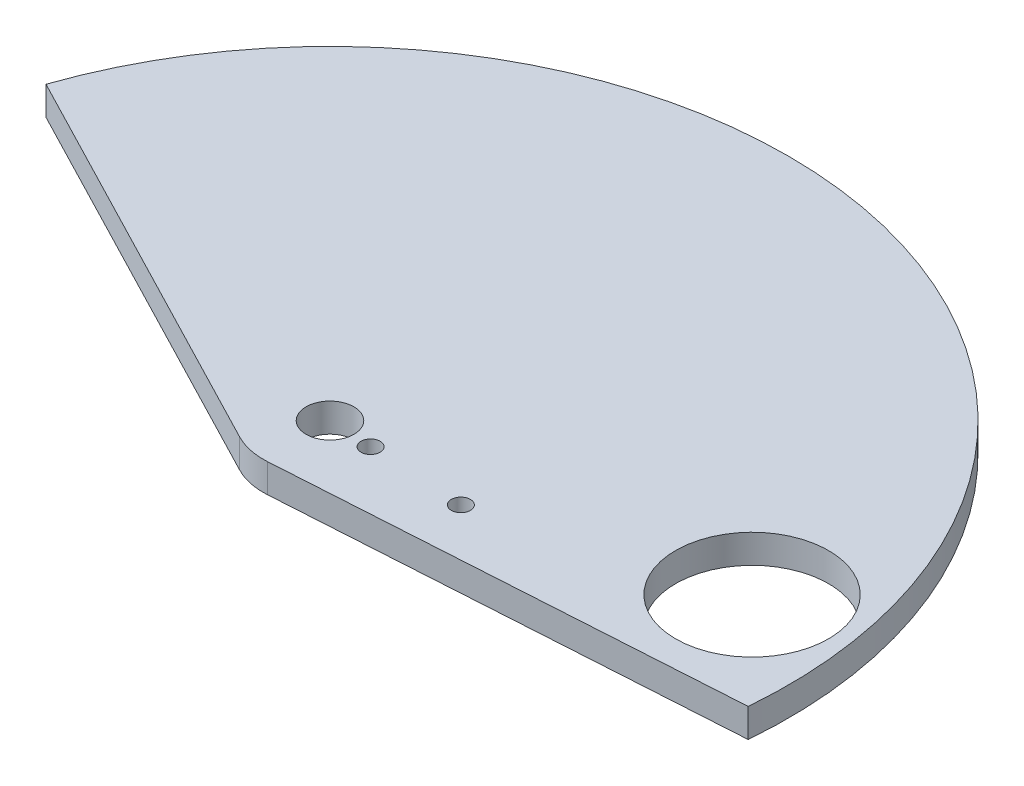
ISO-10303-21;
HEADER;
FILE_DESCRIPTION(('STEP AP214'),'2;1');
FILE_NAME('part.step','',(''),(''),'','','');
FILE_SCHEMA(('AUTOMOTIVE_DESIGN { 1 0 10303 214 1 1 1 1 }'));
ENDSEC;
DATA;
#1=APPLICATION_CONTEXT('core data for automotive mechanical design processes');
#2=APPLICATION_PROTOCOL_DEFINITION('international standard','automotive_design',2000,#1);
#3=PRODUCT_CONTEXT('',#1,'mechanical');
#4=PRODUCT('Part','Part','',(#3));
#5=PRODUCT_RELATED_PRODUCT_CATEGORY('part','',(#4));
#6=PRODUCT_DEFINITION_FORMATION('','',#4);
#7=PRODUCT_DEFINITION_CONTEXT('part definition',#1,'design');
#8=PRODUCT_DEFINITION('design','',#6,#7);
#9=PRODUCT_DEFINITION_SHAPE('','',#8);
#10=(LENGTH_UNIT() NAMED_UNIT(*) SI_UNIT(.MILLI.,.METRE.));
#11=(NAMED_UNIT(*) PLANE_ANGLE_UNIT() SI_UNIT($,.RADIAN.));
#12=(NAMED_UNIT(*) SI_UNIT($,.STERADIAN.) SOLID_ANGLE_UNIT());
#13=UNCERTAINTY_MEASURE_WITH_UNIT(LENGTH_MEASURE(1.E-05),#10,'distance_accuracy_value','');
#14=(GEOMETRIC_REPRESENTATION_CONTEXT(3) GLOBAL_UNCERTAINTY_ASSIGNED_CONTEXT((#13)) GLOBAL_UNIT_ASSIGNED_CONTEXT((#10,
#11,#12)) REPRESENTATION_CONTEXT('',''));
#15=CARTESIAN_POINT('',(0.,0.,0.));
#16=DIRECTION('',(0.,0.,1.));
#17=DIRECTION('',(1.,0.,0.));
#18=AXIS2_PLACEMENT_3D('',#15,#16,#17);
#19=CARTESIAN_POINT('',(0.713081425590482,3.,-1.37503951607775));
#20=DIRECTION('',(0.460367012726996,0.,-0.887728682420942));
#21=DIRECTION('',(-0.887728682420942,0.,-0.460367012726996));
#22=AXIS2_PLACEMENT_3D('',#19,#20,#21);
#23=PLANE('',#22);
#24=DIRECTION('',(0.887728682420942,0.,0.460367012726996));
#25=VECTOR('',#24,1.);
#26=CARTESIAN_POINT('',(0.713081425590482,0.,-1.37503951607775));
#27=LINE('',#26,#25);
#28=CARTESIAN_POINT('',(-38.306620426408,0.,-21.6102577024658));
#29=VERTEX_POINT('',#28);
#30=CARTESIAN_POINT('',(3.77743091091103,0.,0.214100776946594));
#31=VERTEX_POINT('',#30);
#32=EDGE_CURVE('E115',#29,#31,#27,.T.);
#33=ORIENTED_EDGE('',*,*,#32,.T.);
#34=DIRECTION('',(0.,-1.,0.));
#35=VECTOR('',#34,1.);
#36=CARTESIAN_POINT('',(3.77743091091103,3.,0.214100776946594));
#37=LINE('',#36,#35);
#38=CARTESIAN_POINT('',(3.77743091091103,3.,0.214100776946594));
#39=VERTEX_POINT('',#38);
#40=EDGE_CURVE('E11',#39,#31,#37,.T.);
#41=ORIENTED_EDGE('',*,*,#40,.F.);
#42=DIRECTION('',(0.887728682420942,0.,0.460367012726996));
#43=VECTOR('',#42,1.);
#44=CARTESIAN_POINT('',(0.713081425590482,3.,-1.37503951607775));
#45=LINE('',#44,#43);
#46=CARTESIAN_POINT('',(-38.306620426408,3.,-21.6102577024658));
#47=VERTEX_POINT('',#46);
#48=EDGE_CURVE('E91',#47,#39,#45,.T.);
#49=ORIENTED_EDGE('',*,*,#48,.F.);
#50=DIRECTION('',(0.,-1.,0.));
#51=VECTOR('',#50,1.);
#52=CARTESIAN_POINT('',(-38.306620426408,3.,-21.6102577024658));
#53=LINE('',#52,#51);
#54=EDGE_CURVE('E99',#47,#29,#53,.T.);
#55=ORIENTED_EDGE('',*,*,#54,.T.);
#56=EDGE_LOOP('',(#33,#41,#49,#55));
#57=FACE_BOUND('',#56,.T.);
#58=ADVANCED_FACE('F39',(#57),#23,.F.);
#59=CARTESIAN_POINT('',(7.,3.,-6.00000000000001));
#60=DIRECTION('',(0.,-1.,0.));
#61=DIRECTION('',(0.,0.,-1.));
#62=AXIS2_PLACEMENT_3D('',#59,#60,#61);
#63=CYLINDRICAL_SURFACE('',#62,7.);
#64=CARTESIAN_POINT('',(7.,0.,-6.00000000000001));
#65=DIRECTION('',(0.,1.,0.));
#66=DIRECTION('',(0.,0.,1.));
#67=AXIS2_PLACEMENT_3D('',#64,#65,#66);
#68=CIRCLE('',#67,7.);
#69=CARTESIAN_POINT('',(7.43802830898424,0.,0.986281643372844));
#70=VERTEX_POINT('',#69);
#71=EDGE_CURVE('E95',#31,#70,#68,.T.);
#72=ORIENTED_EDGE('',*,*,#71,.T.);
#73=DIRECTION('',(0.,-1.,0.));
#74=VECTOR('',#73,1.);
#75=CARTESIAN_POINT('',(7.43802830898424,3.,0.986281643372844));
#76=LINE('',#75,#74);
#77=CARTESIAN_POINT('',(7.43802830898424,3.,0.986281643372844));
#78=VERTEX_POINT('',#77);
#79=EDGE_CURVE('E48',#78,#70,#76,.T.);
#80=ORIENTED_EDGE('',*,*,#79,.F.);
#81=CARTESIAN_POINT('',(7.,3.,-6.00000000000001));
#82=DIRECTION('',(0.,1.,0.));
#83=DIRECTION('',(0.,0.,1.));
#84=AXIS2_PLACEMENT_3D('',#81,#82,#83);
#85=CIRCLE('',#84,7.);
#86=EDGE_CURVE('E86',#39,#78,#85,.T.);
#87=ORIENTED_EDGE('',*,*,#86,.F.);
#88=ORIENTED_EDGE('',*,*,#40,.T.);
#89=EDGE_LOOP('',(#72,#80,#87,#88));
#90=FACE_BOUND('',#89,.T.);
#91=ADVANCED_FACE('F94',(#90),#63,.T.);
#92=CARTESIAN_POINT('',(0.0907211006229261,3.,1.44694565841711));
#93=DIRECTION('',(-0.0625754727120338,0.,-0.99804023476755));
#94=DIRECTION('',(-0.99804023476755,0.,0.0625754727120338));
#95=AXIS2_PLACEMENT_3D('',#92,#93,#94);
#96=PLANE('',#95);
#97=DIRECTION('',(0.99804023476755,0.,-0.0625754727120338));
#98=VECTOR('',#97,1.);
#99=CARTESIAN_POINT('',(0.0907211006229261,0.,1.44694565841711));
#100=LINE('',#99,#98);
#101=CARTESIAN_POINT('',(54.7515569899819,0.,-1.98019838393523));
#102=VERTEX_POINT('',#101);
#103=EDGE_CURVE('E73',#70,#102,#100,.T.);
#104=ORIENTED_EDGE('',*,*,#103,.T.);
#105=DIRECTION('',(0.,-1.,0.));
#106=VECTOR('',#105,1.);
#107=CARTESIAN_POINT('',(54.7515569899819,3.,-1.98019838393523));
#108=LINE('',#107,#106);
#109=CARTESIAN_POINT('',(54.7515569899819,3.,-1.98019838393523));
#110=VERTEX_POINT('',#109);
#111=EDGE_CURVE('E96',#110,#102,#108,.T.);
#112=ORIENTED_EDGE('',*,*,#111,.F.);
#113=DIRECTION('',(0.99804023476755,0.,-0.0625754727120338));
#114=VECTOR('',#113,1.);
#115=CARTESIAN_POINT('',(0.0907211006229261,3.,1.44694565841711));
#116=LINE('',#115,#114);
#117=EDGE_CURVE('E89',#78,#110,#116,.T.);
#118=ORIENTED_EDGE('',*,*,#117,.F.);
#119=ORIENTED_EDGE('',*,*,#79,.T.);
#120=EDGE_LOOP('',(#104,#112,#118,#119));
#121=FACE_BOUND('',#120,.T.);
#122=ADVANCED_FACE('F97',(#121),#96,.F.);
#123=CARTESIAN_POINT('',(21.4782617262018,3.,-5.206314049765));
#124=DIRECTION('',(0.,-1.,0.));
#125=DIRECTION('',(0.,0.,-1.));
#126=AXIS2_PLACEMENT_3D('',#123,#124,#125);
#127=CYLINDRICAL_SURFACE('',#126,1.);
#128=CARTESIAN_POINT('',(21.4782617262018,3.,-5.206314049765));
#129=DIRECTION('',(0.,1.,0.));
#130=DIRECTION('',(0.,0.,1.));
#131=AXIS2_PLACEMENT_3D('',#128,#129,#130);
#132=CIRCLE('',#131,1.);
#133=CARTESIAN_POINT('',(21.4782617262018,3.,-4.206314049765));
#134=VERTEX_POINT('',#133);
#135=EDGE_CURVE('E128',#134,#134,#132,.T.);
#136=ORIENTED_EDGE('',*,*,#135,.T.);
#137=EDGE_LOOP('',(#136));
#138=FACE_BOUND('',#137,.T.);
#139=CARTESIAN_POINT('',(21.4782617262018,0.,-5.206314049765));
#140=DIRECTION('',(0.,1.,0.));
#141=DIRECTION('',(0.,0.,1.));
#142=AXIS2_PLACEMENT_3D('',#139,#140,#141);
#143=CIRCLE('',#142,1.);
#144=CARTESIAN_POINT('',(21.4782617262018,0.,-4.206314049765));
#145=VERTEX_POINT('',#144);
#146=EDGE_CURVE('E112',#145,#145,#143,.T.);
#147=ORIENTED_EDGE('',*,*,#146,.F.);
#148=EDGE_LOOP('',(#147));
#149=FACE_BOUND('',#148,.T.);
#150=ADVANCED_FACE('F152',(#138,#149),#127,.F.);
#151=CARTESIAN_POINT('',(7.,3.,-6.00000000000001));
#152=DIRECTION('',(0.,-1.,0.));
#153=DIRECTION('',(0.,0.,-1.));
#154=AXIS2_PLACEMENT_3D('',#151,#152,#153);
#155=CYLINDRICAL_SURFACE('',#154,2.5);
#156=CARTESIAN_POINT('',(7.,3.,-6.00000000000001));
#157=DIRECTION('',(0.,1.,0.));
#158=DIRECTION('',(0.,0.,1.));
#159=AXIS2_PLACEMENT_3D('',#156,#157,#158);
#160=CIRCLE('',#159,2.5);
#161=CARTESIAN_POINT('',(7.,3.,-3.5));
#162=VERTEX_POINT('',#161);
#163=EDGE_CURVE('E130',#162,#162,#160,.T.);
#164=ORIENTED_EDGE('',*,*,#163,.T.);
#165=EDGE_LOOP('',(#164));
#166=FACE_BOUND('',#165,.T.);
#167=CARTESIAN_POINT('',(7.,0.,-6.00000000000001));
#168=DIRECTION('',(0.,1.,0.));
#169=DIRECTION('',(0.,0.,1.));
#170=AXIS2_PLACEMENT_3D('',#167,#168,#169);
#171=CIRCLE('',#170,2.5);
#172=CARTESIAN_POINT('',(7.,0.,-3.5));
#173=VERTEX_POINT('',#172);
#174=EDGE_CURVE('E109',#173,#173,#171,.T.);
#175=ORIENTED_EDGE('',*,*,#174,.F.);
#176=EDGE_LOOP('',(#175));
#177=FACE_BOUND('',#176,.T.);
#178=ADVANCED_FACE('F155',(#166,#177),#155,.F.);
#179=CARTESIAN_POINT('',(44.8344847924293,3.,-12.3014129722651));
#180=DIRECTION('',(0.,-1.,0.));
#181=DIRECTION('',(0.,0.,-1.));
#182=AXIS2_PLACEMENT_3D('',#179,#180,#181);
#183=CYLINDRICAL_SURFACE('',#182,7.99999999999999);
#184=CARTESIAN_POINT('',(44.8344847924293,3.,-12.3014129722651));
#185=DIRECTION('',(0.,1.,0.));
#186=DIRECTION('',(0.,0.,1.));
#187=AXIS2_PLACEMENT_3D('',#184,#185,#186);
#188=CIRCLE('',#187,7.99999999999999);
#189=CARTESIAN_POINT('',(44.8344847924293,3.,-4.30141297226512));
#190=VERTEX_POINT('',#189);
#191=EDGE_CURVE('E135',#190,#190,#188,.T.);
#192=ORIENTED_EDGE('',*,*,#191,.T.);
#193=EDGE_LOOP('',(#192));
#194=FACE_BOUND('',#193,.T.);
#195=CARTESIAN_POINT('',(44.8344847924293,0.,-12.3014129722651));
#196=DIRECTION('',(0.,1.,0.));
#197=DIRECTION('',(0.,0.,1.));
#198=AXIS2_PLACEMENT_3D('',#195,#196,#197);
#199=CIRCLE('',#198,7.99999999999999);
#200=CARTESIAN_POINT('',(44.8344847924293,0.,-4.30141297226512));
#201=VERTEX_POINT('',#200);
#202=EDGE_CURVE('E106',#201,#201,#199,.T.);
#203=ORIENTED_EDGE('',*,*,#202,.F.);
#204=EDGE_LOOP('',(#203));
#205=FACE_BOUND('',#204,.T.);
#206=ADVANCED_FACE('F175',(#194,#205),#183,.F.);
#207=CARTESIAN_POINT('',(11.493253639166,3.,-5.75368367061673));
#208=DIRECTION('',(0.,-1.,0.));
#209=DIRECTION('',(0.,0.,-1.));
#210=AXIS2_PLACEMENT_3D('',#207,#208,#209);
#211=CYLINDRICAL_SURFACE('',#210,1.);
#212=CARTESIAN_POINT('',(11.493253639166,3.,-5.75368367061673));
#213=DIRECTION('',(0.,1.,0.));
#214=DIRECTION('',(0.,0.,1.));
#215=AXIS2_PLACEMENT_3D('',#212,#213,#214);
#216=CIRCLE('',#215,1.);
#217=CARTESIAN_POINT('',(11.493253639166,3.,-4.75368367061673));
#218=VERTEX_POINT('',#217);
#219=EDGE_CURVE('E121',#218,#218,#216,.T.);
#220=ORIENTED_EDGE('',*,*,#219,.T.);
#221=EDGE_LOOP('',(#220));
#222=FACE_BOUND('',#221,.T.);
#223=CARTESIAN_POINT('',(11.493253639166,0.,-5.75368367061673));
#224=DIRECTION('',(0.,1.,0.));
#225=DIRECTION('',(0.,0.,1.));
#226=AXIS2_PLACEMENT_3D('',#223,#224,#225);
#227=CIRCLE('',#226,1.);
#228=CARTESIAN_POINT('',(11.493253639166,0.,-4.75368367061673));
#229=VERTEX_POINT('',#228);
#230=EDGE_CURVE('E103',#229,#229,#227,.T.);
#231=ORIENTED_EDGE('',*,*,#230,.F.);
#232=EDGE_LOOP('',(#231));
#233=FACE_BOUND('',#232,.T.);
#234=ADVANCED_FACE('F41',(#222,#233),#211,.F.);
#235=CARTESIAN_POINT('',(7.,3.,-6.00000000000001));
#236=DIRECTION('',(0.,-1.,0.));
#237=DIRECTION('',(0.,0.,-1.));
#238=AXIS2_PLACEMENT_3D('',#235,#236,#237);
#239=CYLINDRICAL_SURFACE('',#238,47.9204549227155);
#240=CARTESIAN_POINT('',(7.,0.,-6.00000000000001));
#241=DIRECTION('',(0.,1.,0.));
#242=DIRECTION('',(0.,0.,1.));
#243=AXIS2_PLACEMENT_3D('',#240,#241,#242);
#244=CIRCLE('',#243,47.9204549227155);
#245=EDGE_CURVE('E79',#102,#29,#244,.T.);
#246=ORIENTED_EDGE('',*,*,#245,.T.);
#247=ORIENTED_EDGE('',*,*,#54,.F.);
#248=CARTESIAN_POINT('',(7.,3.,-6.00000000000001));
#249=DIRECTION('',(0.,1.,0.));
#250=DIRECTION('',(0.,0.,1.));
#251=AXIS2_PLACEMENT_3D('',#248,#249,#250);
#252=CIRCLE('',#251,47.9204549227155);
#253=EDGE_CURVE('E56',#110,#47,#252,.T.);
#254=ORIENTED_EDGE('',*,*,#253,.F.);
#255=ORIENTED_EDGE('',*,*,#111,.T.);
#256=EDGE_LOOP('',(#246,#247,#254,#255));
#257=FACE_BOUND('',#256,.T.);
#258=ADVANCED_FACE('F123',(#257),#239,.T.);
#259=CARTESIAN_POINT('',(0.,3.,0.));
#260=DIRECTION('',(0.,1.,0.));
#261=DIRECTION('',(0.,0.,1.));
#262=AXIS2_PLACEMENT_3D('',#259,#260,#261);
#263=PLANE('',#262);
#264=ORIENTED_EDGE('',*,*,#219,.F.);
#265=EDGE_LOOP('',(#264));
#266=FACE_BOUND('',#265,.T.);
#267=ORIENTED_EDGE('',*,*,#191,.F.);
#268=EDGE_LOOP('',(#267));
#269=FACE_BOUND('',#268,.T.);
#270=ORIENTED_EDGE('',*,*,#163,.F.);
#271=EDGE_LOOP('',(#270));
#272=FACE_BOUND('',#271,.T.);
#273=ORIENTED_EDGE('',*,*,#135,.F.);
#274=EDGE_LOOP('',(#273));
#275=FACE_BOUND('',#274,.T.);
#276=ORIENTED_EDGE('',*,*,#48,.T.);
#277=ORIENTED_EDGE('',*,*,#86,.T.);
#278=ORIENTED_EDGE('',*,*,#117,.T.);
#279=ORIENTED_EDGE('',*,*,#253,.T.);
#280=EDGE_LOOP('',(#276,#277,#278,#279));
#281=FACE_BOUND('',#280,.T.);
#282=ADVANCED_FACE('F87',(#266,#269,#272,#275,#281),#263,.T.);
#283=CARTESIAN_POINT('',(0.,0.,0.));
#284=DIRECTION('',(0.,1.,0.));
#285=DIRECTION('',(0.,0.,1.));
#286=AXIS2_PLACEMENT_3D('',#283,#284,#285);
#287=PLANE('',#286);
#288=ORIENTED_EDGE('',*,*,#230,.T.);
#289=EDGE_LOOP('',(#288));
#290=FACE_BOUND('',#289,.T.);
#291=ORIENTED_EDGE('',*,*,#202,.T.);
#292=EDGE_LOOP('',(#291));
#293=FACE_BOUND('',#292,.T.);
#294=ORIENTED_EDGE('',*,*,#174,.T.);
#295=EDGE_LOOP('',(#294));
#296=FACE_BOUND('',#295,.T.);
#297=ORIENTED_EDGE('',*,*,#146,.T.);
#298=EDGE_LOOP('',(#297));
#299=FACE_BOUND('',#298,.T.);
#300=ORIENTED_EDGE('',*,*,#32,.F.);
#301=ORIENTED_EDGE('',*,*,#245,.F.);
#302=ORIENTED_EDGE('',*,*,#103,.F.);
#303=ORIENTED_EDGE('',*,*,#71,.F.);
#304=EDGE_LOOP('',(#300,#301,#302,#303));
#305=FACE_BOUND('',#304,.T.);
#306=ADVANCED_FACE('F126',(#290,#293,#296,#299,#305),#287,.F.);
#307=CLOSED_SHELL('',(#58,#91,#122,#150,#178,#206,#234,#258,#282,#306));
#308=MANIFOLD_SOLID_BREP('B2',#307);
#309=ADVANCED_BREP_SHAPE_REPRESENTATION('',(#18,#308),#14);
#310=SHAPE_DEFINITION_REPRESENTATION(#9,#309);
ENDSEC;
END-ISO-10303-21;
